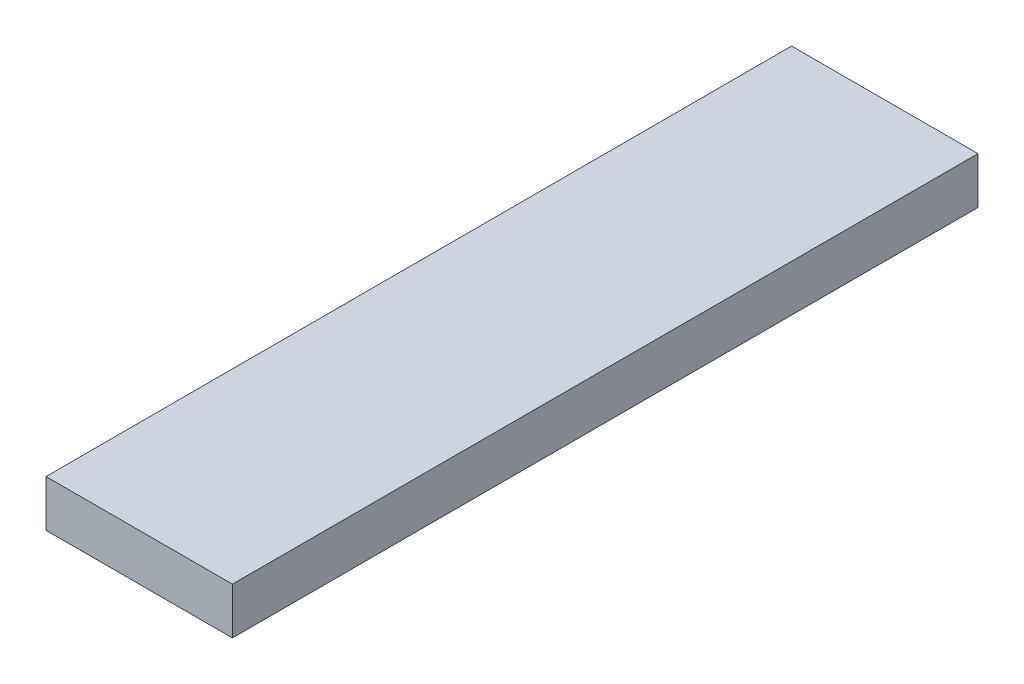
ISO-10303-21;
HEADER;
FILE_DESCRIPTION(('STEP AP214'),'2;1');
FILE_NAME('part.step','',(''),(''),'','','');
FILE_SCHEMA(('AUTOMOTIVE_DESIGN { 1 0 10303 214 1 1 1 1 }'));
ENDSEC;
DATA;
#1=APPLICATION_CONTEXT('core data for automotive mechanical design processes');
#2=APPLICATION_PROTOCOL_DEFINITION('international standard','automotive_design',2000,#1);
#3=PRODUCT_CONTEXT('',#1,'mechanical');
#4=PRODUCT('Part','Part','',(#3));
#5=PRODUCT_RELATED_PRODUCT_CATEGORY('part','',(#4));
#6=PRODUCT_DEFINITION_FORMATION('','',#4);
#7=PRODUCT_DEFINITION_CONTEXT('part definition',#1,'design');
#8=PRODUCT_DEFINITION('design','',#6,#7);
#9=PRODUCT_DEFINITION_SHAPE('','',#8);
#10=(LENGTH_UNIT() NAMED_UNIT(*) SI_UNIT(.MILLI.,.METRE.));
#11=(NAMED_UNIT(*) PLANE_ANGLE_UNIT() SI_UNIT($,.RADIAN.));
#12=(NAMED_UNIT(*) SI_UNIT($,.STERADIAN.) SOLID_ANGLE_UNIT());
#13=UNCERTAINTY_MEASURE_WITH_UNIT(LENGTH_MEASURE(1.E-05),#10,'distance_accuracy_value','');
#14=(GEOMETRIC_REPRESENTATION_CONTEXT(3) GLOBAL_UNCERTAINTY_ASSIGNED_CONTEXT((#13)) GLOBAL_UNIT_ASSIGNED_CONTEXT((#10,
#11,#12)) REPRESENTATION_CONTEXT('',''));
#15=CARTESIAN_POINT('',(0.,0.,0.));
#16=DIRECTION('',(0.,0.,1.));
#17=DIRECTION('',(1.,0.,0.));
#18=AXIS2_PLACEMENT_3D('',#15,#16,#17);
#19=CARTESIAN_POINT('',(-4.,-2.,32.));
#20=DIRECTION('',(1.,0.,0.));
#21=DIRECTION('',(0.,0.,-1.));
#22=AXIS2_PLACEMENT_3D('',#19,#20,#21);
#23=PLANE('',#22);
#24=DIRECTION('',(0.,-1.,0.));
#25=VECTOR('',#24,1.);
#26=CARTESIAN_POINT('',(-4.,-2.,0.));
#27=LINE('',#26,#25);
#28=CARTESIAN_POINT('',(-4.,0.,0.));
#29=VERTEX_POINT('',#28);
#30=CARTESIAN_POINT('',(-4.,-2.,0.));
#31=VERTEX_POINT('',#30);
#32=EDGE_CURVE('E119',#29,#31,#27,.T.);
#33=ORIENTED_EDGE('',*,*,#32,.T.);
#34=DIRECTION('',(0.,0.,-1.));
#35=VECTOR('',#34,1.);
#36=CARTESIAN_POINT('',(-4.,-2.,32.));
#37=LINE('',#36,#35);
#38=CARTESIAN_POINT('',(-4.,-2.,32.));
#39=VERTEX_POINT('',#38);
#40=EDGE_CURVE('E98',#39,#31,#37,.T.);
#41=ORIENTED_EDGE('',*,*,#40,.F.);
#42=DIRECTION('',(0.,-1.,0.));
#43=VECTOR('',#42,1.);
#44=CARTESIAN_POINT('',(-4.,-2.,32.));
#45=LINE('',#44,#43);
#46=CARTESIAN_POINT('',(-4.,0.,32.));
#47=VERTEX_POINT('',#46);
#48=EDGE_CURVE('E107',#47,#39,#45,.T.);
#49=ORIENTED_EDGE('',*,*,#48,.F.);
#50=DIRECTION('',(0.,0.,-1.));
#51=VECTOR('',#50,1.);
#52=CARTESIAN_POINT('',(-4.,0.,32.));
#53=LINE('',#52,#51);
#54=EDGE_CURVE('E153',#47,#29,#53,.T.);
#55=ORIENTED_EDGE('',*,*,#54,.T.);
#56=EDGE_LOOP('',(#33,#41,#49,#55));
#57=FACE_BOUND('',#56,.T.);
#58=ADVANCED_FACE('F41',(#57),#23,.F.);
#59=CARTESIAN_POINT('',(-2.5,-3.5,32.));
#60=DIRECTION('',(0.707106781186547,0.707106781186548,0.));
#61=DIRECTION('',(-0.707106781186548,0.707106781186547,0.));
#62=AXIS2_PLACEMENT_3D('',#59,#60,#61);
#63=PLANE('',#62);
#64=ORIENTED_EDGE('',*,*,#40,.T.);
#65=DIRECTION('',(0.577350269189627,-0.577350269189626,0.577350269189624));
#66=VECTOR('',#65,1.);
#67=CARTESIAN_POINT('',(-0.833333333333325,-5.16666666666667,3.16666666666667));
#68=LINE('',#67,#66);
#69=CARTESIAN_POINT('',(-2.5,-3.5,1.5));
#70=VERTEX_POINT('',#69);
#71=EDGE_CURVE('E50',#31,#70,#68,.T.);
#72=ORIENTED_EDGE('',*,*,#71,.T.);
#73=DIRECTION('',(0.,0.,-1.));
#74=VECTOR('',#73,1.);
#75=CARTESIAN_POINT('',(-2.5,-3.5,32.));
#76=LINE('',#75,#74);
#77=CARTESIAN_POINT('',(-2.5,-3.5,30.5));
#78=VERTEX_POINT('',#77);
#79=EDGE_CURVE('E100',#78,#70,#76,.T.);
#80=ORIENTED_EDGE('',*,*,#79,.F.);
#81=DIRECTION('',(0.577350269189626,-0.577350269189625,-0.577350269189627));
#82=VECTOR('',#81,1.);
#83=CARTESIAN_POINT('',(-2.66666666666667,-3.33333333333333,30.6666666666667));
#84=LINE('',#83,#82);
#85=EDGE_CURVE('E94',#78,#39,#84,.F.);
#86=ORIENTED_EDGE('',*,*,#85,.T.);
#87=EDGE_LOOP('',(#64,#72,#80,#86));
#88=FACE_BOUND('',#87,.T.);
#89=ADVANCED_FACE('F96',(#88),#63,.F.);
#90=CARTESIAN_POINT('',(2.5,-3.5,32.));
#91=DIRECTION('',(0.,1.,0.));
#92=DIRECTION('',(0.,0.,1.));
#93=AXIS2_PLACEMENT_3D('',#90,#91,#92);
#94=PLANE('',#93);
#95=ORIENTED_EDGE('',*,*,#79,.T.);
#96=DIRECTION('',(1.,0.,0.));
#97=VECTOR('',#96,1.);
#98=CARTESIAN_POINT('',(2.5,-3.5,1.5));
#99=LINE('',#98,#97);
#100=CARTESIAN_POINT('',(2.5,-3.5,1.5));
#101=VERTEX_POINT('',#100);
#102=EDGE_CURVE('E125',#70,#101,#99,.T.);
#103=ORIENTED_EDGE('',*,*,#102,.T.);
#104=DIRECTION('',(0.,0.,-1.));
#105=VECTOR('',#104,1.);
#106=CARTESIAN_POINT('',(2.5,-3.5,32.));
#107=LINE('',#106,#105);
#108=CARTESIAN_POINT('',(2.5,-3.5,30.5));
#109=VERTEX_POINT('',#108);
#110=EDGE_CURVE('E142',#109,#101,#107,.T.);
#111=ORIENTED_EDGE('',*,*,#110,.F.);
#112=DIRECTION('',(-1.,0.,0.));
#113=VECTOR('',#112,1.);
#114=CARTESIAN_POINT('',(2.5,-3.5,30.5));
#115=LINE('',#114,#113);
#116=EDGE_CURVE('E63',#109,#78,#115,.T.);
#117=ORIENTED_EDGE('',*,*,#116,.T.);
#118=EDGE_LOOP('',(#95,#103,#111,#117));
#119=FACE_BOUND('',#118,.T.);
#120=ADVANCED_FACE('F141',(#119),#94,.F.);
#121=CARTESIAN_POINT('',(4.,-2.,32.));
#122=DIRECTION('',(-0.707106781186547,0.707106781186548,0.));
#123=DIRECTION('',(-0.707106781186548,-0.707106781186547,0.));
#124=AXIS2_PLACEMENT_3D('',#121,#122,#123);
#125=PLANE('',#124);
#126=ORIENTED_EDGE('',*,*,#110,.T.);
#127=DIRECTION('',(0.577350269189627,0.577350269189627,-0.577350269189624));
#128=VECTOR('',#127,1.);
#129=CARTESIAN_POINT('',(2.5,-3.5,1.5));
#130=LINE('',#129,#128);
#131=CARTESIAN_POINT('',(4.,-2.,0.));
#132=VERTEX_POINT('',#131);
#133=EDGE_CURVE('E124',#101,#132,#130,.T.);
#134=ORIENTED_EDGE('',*,*,#133,.T.);
#135=DIRECTION('',(0.,0.,-1.));
#136=VECTOR('',#135,1.);
#137=CARTESIAN_POINT('',(4.,-2.,32.));
#138=LINE('',#137,#136);
#139=CARTESIAN_POINT('',(4.,-2.,32.));
#140=VERTEX_POINT('',#139);
#141=EDGE_CURVE('E145',#140,#132,#138,.T.);
#142=ORIENTED_EDGE('',*,*,#141,.F.);
#143=DIRECTION('',(0.577350269189625,0.577350269189625,0.577350269189628));
#144=VECTOR('',#143,1.);
#145=CARTESIAN_POINT('',(2.66666666666667,-3.33333333333333,30.6666666666667));
#146=LINE('',#145,#144);
#147=EDGE_CURVE('E121',#140,#109,#146,.F.);
#148=ORIENTED_EDGE('',*,*,#147,.T.);
#149=EDGE_LOOP('',(#126,#134,#142,#148));
#150=FACE_BOUND('',#149,.T.);
#151=ADVANCED_FACE('F143',(#150),#125,.F.);
#152=CARTESIAN_POINT('',(4.,0.,32.));
#153=DIRECTION('',(-1.,0.,0.));
#154=DIRECTION('',(0.,0.,1.));
#155=AXIS2_PLACEMENT_3D('',#152,#153,#154);
#156=PLANE('',#155);
#157=DIRECTION('',(0.,1.,0.));
#158=VECTOR('',#157,1.);
#159=CARTESIAN_POINT('',(4.,0.,0.));
#160=LINE('',#159,#158);
#161=CARTESIAN_POINT('',(4.,0.,0.));
#162=VERTEX_POINT('',#161);
#163=EDGE_CURVE('E137',#132,#162,#160,.T.);
#164=ORIENTED_EDGE('',*,*,#163,.T.);
#165=DIRECTION('',(0.,0.,-1.));
#166=VECTOR('',#165,1.);
#167=CARTESIAN_POINT('',(4.,0.,32.));
#168=LINE('',#167,#166);
#169=CARTESIAN_POINT('',(4.,0.,32.));
#170=VERTEX_POINT('',#169);
#171=EDGE_CURVE('E148',#170,#162,#168,.T.);
#172=ORIENTED_EDGE('',*,*,#171,.F.);
#173=DIRECTION('',(0.,1.,0.));
#174=VECTOR('',#173,1.);
#175=CARTESIAN_POINT('',(4.,0.,32.));
#176=LINE('',#175,#174);
#177=EDGE_CURVE('E115',#140,#170,#176,.T.);
#178=ORIENTED_EDGE('',*,*,#177,.F.);
#179=ORIENTED_EDGE('',*,*,#141,.T.);
#180=EDGE_LOOP('',(#164,#172,#178,#179));
#181=FACE_BOUND('',#180,.T.);
#182=ADVANCED_FACE('F162',(#181),#156,.F.);
#183=CARTESIAN_POINT('',(-4.,0.,32.));
#184=DIRECTION('',(0.,-1.,0.));
#185=DIRECTION('',(1.,0.,0.));
#186=AXIS2_PLACEMENT_3D('',#183,#184,#185);
#187=PLANE('',#186);
#188=DIRECTION('',(-1.,0.,0.));
#189=VECTOR('',#188,1.);
#190=CARTESIAN_POINT('',(-4.,0.,0.));
#191=LINE('',#190,#189);
#192=EDGE_CURVE('E116',#162,#29,#191,.T.);
#193=ORIENTED_EDGE('',*,*,#192,.T.);
#194=ORIENTED_EDGE('',*,*,#54,.F.);
#195=DIRECTION('',(-1.,0.,0.));
#196=VECTOR('',#195,1.);
#197=CARTESIAN_POINT('',(-4.,0.,32.));
#198=LINE('',#197,#196);
#199=EDGE_CURVE('E111',#170,#47,#198,.T.);
#200=ORIENTED_EDGE('',*,*,#199,.F.);
#201=ORIENTED_EDGE('',*,*,#171,.T.);
#202=EDGE_LOOP('',(#193,#194,#200,#201));
#203=FACE_BOUND('',#202,.T.);
#204=ADVANCED_FACE('F164',(#203),#187,.F.);
#205=CARTESIAN_POINT('',(0.,0.,32.));
#206=DIRECTION('',(0.,0.,-1.));
#207=DIRECTION('',(-1.,0.,0.));
#208=AXIS2_PLACEMENT_3D('',#205,#206,#207);
#209=PLANE('',#208);
#210=ORIENTED_EDGE('',*,*,#48,.T.);
#211=DIRECTION('',(1.,0.,0.));
#212=VECTOR('',#211,1.);
#213=CARTESIAN_POINT('',(0.,-2.,32.));
#214=LINE('',#213,#212);
#215=EDGE_CURVE('E11',#39,#140,#214,.T.);
#216=ORIENTED_EDGE('',*,*,#215,.T.);
#217=ORIENTED_EDGE('',*,*,#177,.T.);
#218=ORIENTED_EDGE('',*,*,#199,.T.);
#219=EDGE_LOOP('',(#210,#216,#217,#218));
#220=FACE_BOUND('',#219,.T.);
#221=ADVANCED_FACE('F108',(#220),#209,.F.);
#222=CARTESIAN_POINT('',(0.,0.,0.));
#223=DIRECTION('',(0.,0.,-1.));
#224=DIRECTION('',(-1.,0.,0.));
#225=AXIS2_PLACEMENT_3D('',#222,#223,#224);
#226=PLANE('',#225);
#227=ORIENTED_EDGE('',*,*,#163,.F.);
#228=DIRECTION('',(-1.,0.,0.));
#229=VECTOR('',#228,1.);
#230=CARTESIAN_POINT('',(-2.5,-1.99999999999999,0.));
#231=LINE('',#230,#229);
#232=EDGE_CURVE('E103',#132,#31,#231,.T.);
#233=ORIENTED_EDGE('',*,*,#232,.T.);
#234=ORIENTED_EDGE('',*,*,#32,.F.);
#235=ORIENTED_EDGE('',*,*,#192,.F.);
#236=EDGE_LOOP('',(#227,#233,#234,#235));
#237=FACE_BOUND('',#236,.T.);
#238=ADVANCED_FACE('F135',(#237),#226,.T.);
#239=CARTESIAN_POINT('',(2.5,-3.5,1.5));
#240=DIRECTION('',(0.,-0.707106781186546,-0.707106781186549));
#241=DIRECTION('',(-1.,0.,0.));
#242=AXIS2_PLACEMENT_3D('',#239,#240,#241);
#243=PLANE('',#242);
#244=ORIENTED_EDGE('',*,*,#71,.F.);
#245=ORIENTED_EDGE('',*,*,#232,.F.);
#246=ORIENTED_EDGE('',*,*,#133,.F.);
#247=ORIENTED_EDGE('',*,*,#102,.F.);
#248=EDGE_LOOP('',(#244,#245,#246,#247));
#249=FACE_BOUND('',#248,.T.);
#250=ADVANCED_FACE('F139',(#249),#243,.T.);
#251=CARTESIAN_POINT('',(0.,-2.,32.));
#252=DIRECTION('',(0.,0.707106781186549,-0.707106781186546));
#253=DIRECTION('',(1.,0.,0.));
#254=AXIS2_PLACEMENT_3D('',#251,#252,#253);
#255=PLANE('',#254);
#256=ORIENTED_EDGE('',*,*,#85,.F.);
#257=ORIENTED_EDGE('',*,*,#116,.F.);
#258=ORIENTED_EDGE('',*,*,#147,.F.);
#259=ORIENTED_EDGE('',*,*,#215,.F.);
#260=EDGE_LOOP('',(#256,#257,#258,#259));
#261=FACE_BOUND('',#260,.T.);
#262=ADVANCED_FACE('F44',(#261),#255,.F.);
#263=CLOSED_SHELL('',(#58,#89,#120,#151,#182,#204,#221,#238,#250,#262));
#264=MANIFOLD_SOLID_BREP('B2',#263);
#265=ADVANCED_BREP_SHAPE_REPRESENTATION('',(#18,#264),#14);
#266=SHAPE_DEFINITION_REPRESENTATION(#9,#265);
ENDSEC;
END-ISO-10303-21;
